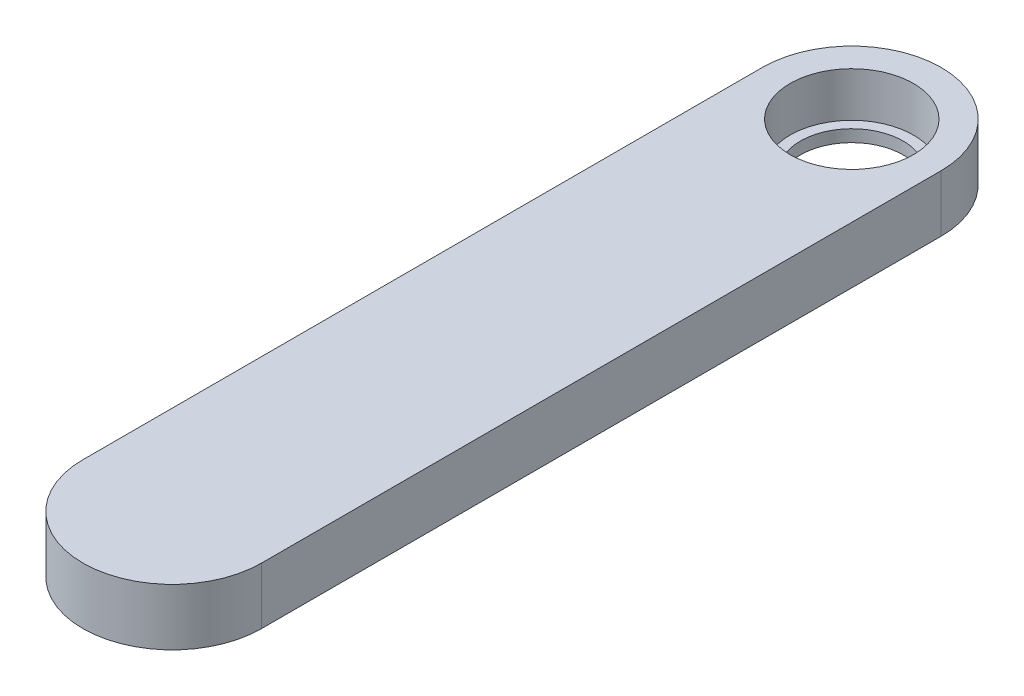
ISO-10303-21;
HEADER;
FILE_DESCRIPTION(('STEP AP214'),'2;1');
FILE_NAME('part.step','',(''),(''),'','','');
FILE_SCHEMA(('AUTOMOTIVE_DESIGN { 1 0 10303 214 1 1 1 1 }'));
ENDSEC;
DATA;
#1=APPLICATION_CONTEXT('core data for automotive mechanical design processes');
#2=APPLICATION_PROTOCOL_DEFINITION('international standard','automotive_design',2000,#1);
#3=PRODUCT_CONTEXT('',#1,'mechanical');
#4=PRODUCT('Part','Part','',(#3));
#5=PRODUCT_RELATED_PRODUCT_CATEGORY('part','',(#4));
#6=PRODUCT_DEFINITION_FORMATION('','',#4);
#7=PRODUCT_DEFINITION_CONTEXT('part definition',#1,'design');
#8=PRODUCT_DEFINITION('design','',#6,#7);
#9=PRODUCT_DEFINITION_SHAPE('','',#8);
#10=(LENGTH_UNIT() NAMED_UNIT(*) SI_UNIT(.MILLI.,.METRE.));
#11=(NAMED_UNIT(*) PLANE_ANGLE_UNIT() SI_UNIT($,.RADIAN.));
#12=(NAMED_UNIT(*) SI_UNIT($,.STERADIAN.) SOLID_ANGLE_UNIT());
#13=UNCERTAINTY_MEASURE_WITH_UNIT(LENGTH_MEASURE(1.E-05),#10,'distance_accuracy_value','');
#14=(GEOMETRIC_REPRESENTATION_CONTEXT(3) GLOBAL_UNCERTAINTY_ASSIGNED_CONTEXT((#13)) GLOBAL_UNIT_ASSIGNED_CONTEXT((#10,
#11,#12)) REPRESENTATION_CONTEXT('',''));
#15=CARTESIAN_POINT('',(0.,0.,0.));
#16=DIRECTION('',(0.,0.,1.));
#17=DIRECTION('',(1.,0.,0.));
#18=AXIS2_PLACEMENT_3D('',#15,#16,#17);
#19=CARTESIAN_POINT('',(0.,1.5875,-19.));
#20=DIRECTION('',(0.,-1.,0.));
#21=DIRECTION('',(0.,0.,-1.));
#22=AXIS2_PLACEMENT_3D('',#19,#20,#21);
#23=CYLINDRICAL_SURFACE('',#22,5.);
#24=CARTESIAN_POINT('',(0.,-1.5875,-19.));
#25=DIRECTION('',(0.,1.,0.));
#26=DIRECTION('',(0.,0.,1.));
#27=AXIS2_PLACEMENT_3D('',#24,#25,#26);
#28=CIRCLE('',#27,5.);
#29=CARTESIAN_POINT('',(-5.,-1.5875,-19.));
#30=VERTEX_POINT('',#29);
#31=CARTESIAN_POINT('',(5.,-1.5875,-19.));
#32=VERTEX_POINT('',#31);
#33=EDGE_CURVE('E117',#30,#32,#28,.F.);
#34=ORIENTED_EDGE('',*,*,#33,.F.);
#35=DIRECTION('',(0.,-1.,0.));
#36=VECTOR('',#35,1.);
#37=CARTESIAN_POINT('',(-5.,1.5875,-19.));
#38=LINE('',#37,#36);
#39=CARTESIAN_POINT('',(-5.,1.5875,-19.));
#40=VERTEX_POINT('',#39);
#41=EDGE_CURVE('E11',#40,#30,#38,.T.);
#42=ORIENTED_EDGE('',*,*,#41,.F.);
#43=CARTESIAN_POINT('',(0.,1.5875,-19.));
#44=DIRECTION('',(0.,1.,0.));
#45=DIRECTION('',(0.,0.,1.));
#46=AXIS2_PLACEMENT_3D('',#43,#44,#45);
#47=CIRCLE('',#46,5.);
#48=CARTESIAN_POINT('',(5.,1.5875,-19.));
#49=VERTEX_POINT('',#48);
#50=EDGE_CURVE('E107',#40,#49,#47,.F.);
#51=ORIENTED_EDGE('',*,*,#50,.T.);
#52=DIRECTION('',(0.,-1.,0.));
#53=VECTOR('',#52,1.);
#54=CARTESIAN_POINT('',(5.,1.5875,-19.));
#55=LINE('',#54,#53);
#56=EDGE_CURVE('E86',#49,#32,#55,.T.);
#57=ORIENTED_EDGE('',*,*,#56,.T.);
#58=EDGE_LOOP('',(#34,#42,#51,#57));
#59=FACE_BOUND('',#58,.T.);
#60=ADVANCED_FACE('F47',(#59),#23,.T.);
#61=CARTESIAN_POINT('',(-5.,1.5875,0.));
#62=DIRECTION('',(-1.,0.,0.));
#63=DIRECTION('',(0.,0.,1.));
#64=AXIS2_PLACEMENT_3D('',#61,#62,#63);
#65=PLANE('',#64);
#66=DIRECTION('',(0.,0.,-1.));
#67=VECTOR('',#66,1.);
#68=CARTESIAN_POINT('',(-5.,-1.5875,0.));
#69=LINE('',#68,#67);
#70=CARTESIAN_POINT('',(-5.,-1.5875,19.));
#71=VERTEX_POINT('',#70);
#72=EDGE_CURVE('E99',#71,#30,#69,.T.);
#73=ORIENTED_EDGE('',*,*,#72,.F.);
#74=DIRECTION('',(0.,-1.,0.));
#75=VECTOR('',#74,1.);
#76=CARTESIAN_POINT('',(-5.,1.5875,19.));
#77=LINE('',#76,#75);
#78=CARTESIAN_POINT('',(-5.,1.5875,19.));
#79=VERTEX_POINT('',#78);
#80=EDGE_CURVE('E56',#79,#71,#77,.T.);
#81=ORIENTED_EDGE('',*,*,#80,.F.);
#82=DIRECTION('',(0.,0.,-1.));
#83=VECTOR('',#82,1.);
#84=CARTESIAN_POINT('',(-5.,1.5875,0.));
#85=LINE('',#84,#83);
#86=EDGE_CURVE('E97',#79,#40,#85,.T.);
#87=ORIENTED_EDGE('',*,*,#86,.T.);
#88=ORIENTED_EDGE('',*,*,#41,.T.);
#89=EDGE_LOOP('',(#73,#81,#87,#88));
#90=FACE_BOUND('',#89,.T.);
#91=ADVANCED_FACE('F95',(#90),#65,.T.);
#92=CARTESIAN_POINT('',(0.,1.5875,19.));
#93=DIRECTION('',(0.,-1.,0.));
#94=DIRECTION('',(0.,0.,-1.));
#95=AXIS2_PLACEMENT_3D('',#92,#93,#94);
#96=CYLINDRICAL_SURFACE('',#95,5.);
#97=CARTESIAN_POINT('',(0.,-1.5875,19.));
#98=DIRECTION('',(0.,1.,0.));
#99=DIRECTION('',(0.,0.,1.));
#100=AXIS2_PLACEMENT_3D('',#97,#98,#99);
#101=CIRCLE('',#100,5.);
#102=CARTESIAN_POINT('',(5.00000000000001,-1.5875,19.));
#103=VERTEX_POINT('',#102);
#104=EDGE_CURVE('E79',#71,#103,#101,.T.);
#105=ORIENTED_EDGE('',*,*,#104,.T.);
#106=DIRECTION('',(0.,-1.,0.));
#107=VECTOR('',#106,1.);
#108=CARTESIAN_POINT('',(5.00000000000001,1.5875,19.));
#109=LINE('',#108,#107);
#110=CARTESIAN_POINT('',(5.00000000000001,1.5875,19.));
#111=VERTEX_POINT('',#110);
#112=EDGE_CURVE('E101',#111,#103,#109,.T.);
#113=ORIENTED_EDGE('',*,*,#112,.F.);
#114=CARTESIAN_POINT('',(0.,1.5875,19.));
#115=DIRECTION('',(0.,1.,0.));
#116=DIRECTION('',(0.,0.,1.));
#117=AXIS2_PLACEMENT_3D('',#114,#115,#116);
#118=CIRCLE('',#117,5.);
#119=EDGE_CURVE('E102',#79,#111,#118,.T.);
#120=ORIENTED_EDGE('',*,*,#119,.F.);
#121=ORIENTED_EDGE('',*,*,#80,.T.);
#122=EDGE_LOOP('',(#105,#113,#120,#121));
#123=FACE_BOUND('',#122,.T.);
#124=ADVANCED_FACE('F103',(#123),#96,.T.);
#125=CARTESIAN_POINT('',(5.,1.5875,0.));
#126=DIRECTION('',(-1.,0.,0.));
#127=DIRECTION('',(0.,0.,1.));
#128=AXIS2_PLACEMENT_3D('',#125,#126,#127);
#129=PLANE('',#128);
#130=DIRECTION('',(0.,0.,-1.));
#131=VECTOR('',#130,1.);
#132=CARTESIAN_POINT('',(5.,-1.5875,0.));
#133=LINE('',#132,#131);
#134=EDGE_CURVE('E111',#103,#32,#133,.T.);
#135=ORIENTED_EDGE('',*,*,#134,.T.);
#136=ORIENTED_EDGE('',*,*,#56,.F.);
#137=DIRECTION('',(0.,0.,-1.));
#138=VECTOR('',#137,1.);
#139=CARTESIAN_POINT('',(5.,1.5875,0.));
#140=LINE('',#139,#138);
#141=EDGE_CURVE('E64',#111,#49,#140,.T.);
#142=ORIENTED_EDGE('',*,*,#141,.F.);
#143=ORIENTED_EDGE('',*,*,#112,.T.);
#144=EDGE_LOOP('',(#135,#136,#142,#143));
#145=FACE_BOUND('',#144,.T.);
#146=ADVANCED_FACE('F133',(#145),#129,.F.);
#147=CARTESIAN_POINT('',(0.,1.5875,0.));
#148=DIRECTION('',(0.,1.,0.));
#149=DIRECTION('',(0.,0.,1.));
#150=AXIS2_PLACEMENT_3D('',#147,#148,#149);
#151=PLANE('',#150);
#152=CARTESIAN_POINT('',(0.,1.5875,-19.));
#153=DIRECTION('',(0.,1.,0.));
#154=DIRECTION('',(0.,0.,1.));
#155=AXIS2_PLACEMENT_3D('',#152,#153,#154);
#156=CIRCLE('',#155,3.45);
#157=CARTESIAN_POINT('',(0.,1.5875,-15.55));
#158=VERTEX_POINT('',#157);
#159=EDGE_CURVE('E176',#158,#158,#156,.T.);
#160=ORIENTED_EDGE('',*,*,#159,.F.);
#161=EDGE_LOOP('',(#160));
#162=FACE_BOUND('',#161,.T.);
#163=ORIENTED_EDGE('',*,*,#50,.F.);
#164=ORIENTED_EDGE('',*,*,#86,.F.);
#165=ORIENTED_EDGE('',*,*,#119,.T.);
#166=ORIENTED_EDGE('',*,*,#141,.T.);
#167=EDGE_LOOP('',(#163,#164,#165,#166));
#168=FACE_BOUND('',#167,.T.);
#169=ADVANCED_FACE('F106',(#162,#168),#151,.T.);
#170=CARTESIAN_POINT('',(0.,-1.5875,0.));
#171=DIRECTION('',(0.,1.,0.));
#172=DIRECTION('',(0.,0.,1.));
#173=AXIS2_PLACEMENT_3D('',#170,#171,#172);
#174=PLANE('',#173);
#175=CARTESIAN_POINT('',(0.,-1.5875,-19.));
#176=DIRECTION('',(0.,1.,0.));
#177=DIRECTION('',(0.,0.,1.));
#178=AXIS2_PLACEMENT_3D('',#175,#176,#177);
#179=CIRCLE('',#178,2.875);
#180=CARTESIAN_POINT('',(0.,-1.5875,-16.125));
#181=VERTEX_POINT('',#180);
#182=EDGE_CURVE('E169',#181,#181,#179,.T.);
#183=ORIENTED_EDGE('',*,*,#182,.T.);
#184=EDGE_LOOP('',(#183));
#185=FACE_BOUND('',#184,.T.);
#186=ORIENTED_EDGE('',*,*,#33,.T.);
#187=ORIENTED_EDGE('',*,*,#134,.F.);
#188=ORIENTED_EDGE('',*,*,#104,.F.);
#189=ORIENTED_EDGE('',*,*,#72,.T.);
#190=EDGE_LOOP('',(#186,#187,#188,#189));
#191=FACE_BOUND('',#190,.T.);
#192=ADVANCED_FACE('F135',(#185,#191),#174,.F.);
#193=CARTESIAN_POINT('',(0.,-0.9125,-19.));
#194=DIRECTION('',(0.,1.,0.));
#195=DIRECTION('',(0.,0.,1.));
#196=AXIS2_PLACEMENT_3D('',#193,#194,#195);
#197=CYLINDRICAL_SURFACE('',#196,3.45);
#198=CARTESIAN_POINT('',(0.,-0.9125,-19.));
#199=DIRECTION('',(0.,1.,0.));
#200=DIRECTION('',(0.,0.,1.));
#201=AXIS2_PLACEMENT_3D('',#198,#199,#200);
#202=CIRCLE('',#201,3.45);
#203=CARTESIAN_POINT('',(0.,-0.9125,-15.55));
#204=VERTEX_POINT('',#203);
#205=EDGE_CURVE('E121',#204,#204,#202,.T.);
#206=ORIENTED_EDGE('',*,*,#205,.F.);
#207=EDGE_LOOP('',(#206));
#208=FACE_BOUND('',#207,.T.);
#209=ORIENTED_EDGE('',*,*,#159,.T.);
#210=EDGE_LOOP('',(#209));
#211=FACE_BOUND('',#210,.T.);
#212=ADVANCED_FACE('F149',(#208,#211),#197,.F.);
#213=CARTESIAN_POINT('',(0.,-0.9125,-19.));
#214=DIRECTION('',(0.,1.,0.));
#215=DIRECTION('',(0.,0.,1.));
#216=AXIS2_PLACEMENT_3D('',#213,#214,#215);
#217=PLANE('',#216);
#218=CARTESIAN_POINT('',(0.,-0.9125,-19.));
#219=DIRECTION('',(0.,1.,0.));
#220=DIRECTION('',(0.,0.,1.));
#221=AXIS2_PLACEMENT_3D('',#218,#219,#220);
#222=CIRCLE('',#221,2.875);
#223=CARTESIAN_POINT('',(0.,-0.9125,-16.125));
#224=VERTEX_POINT('',#223);
#225=EDGE_CURVE('E172',#224,#224,#222,.T.);
#226=ORIENTED_EDGE('',*,*,#225,.F.);
#227=EDGE_LOOP('',(#226));
#228=FACE_BOUND('',#227,.T.);
#229=ORIENTED_EDGE('',*,*,#205,.T.);
#230=EDGE_LOOP('',(#229));
#231=FACE_BOUND('',#230,.T.);
#232=ADVANCED_FACE('F156',(#228,#231),#217,.T.);
#233=CARTESIAN_POINT('',(0.,-1.5875,-19.));
#234=DIRECTION('',(0.,1.,0.));
#235=DIRECTION('',(0.,0.,1.));
#236=AXIS2_PLACEMENT_3D('',#233,#234,#235);
#237=CYLINDRICAL_SURFACE('',#236,2.875);
#238=ORIENTED_EDGE('',*,*,#182,.F.);
#239=EDGE_LOOP('',(#238));
#240=FACE_BOUND('',#239,.T.);
#241=ORIENTED_EDGE('',*,*,#225,.T.);
#242=EDGE_LOOP('',(#241));
#243=FACE_BOUND('',#242,.T.);
#244=ADVANCED_FACE('F160',(#240,#243),#237,.F.);
#245=CLOSED_SHELL('',(#60,#91,#124,#146,#169,#192,#212,#232,#244));
#246=MANIFOLD_SOLID_BREP('B2',#245);
#247=ADVANCED_BREP_SHAPE_REPRESENTATION('',(#18,#246),#14);
#248=SHAPE_DEFINITION_REPRESENTATION(#9,#247);
ENDSEC;
END-ISO-10303-21;
